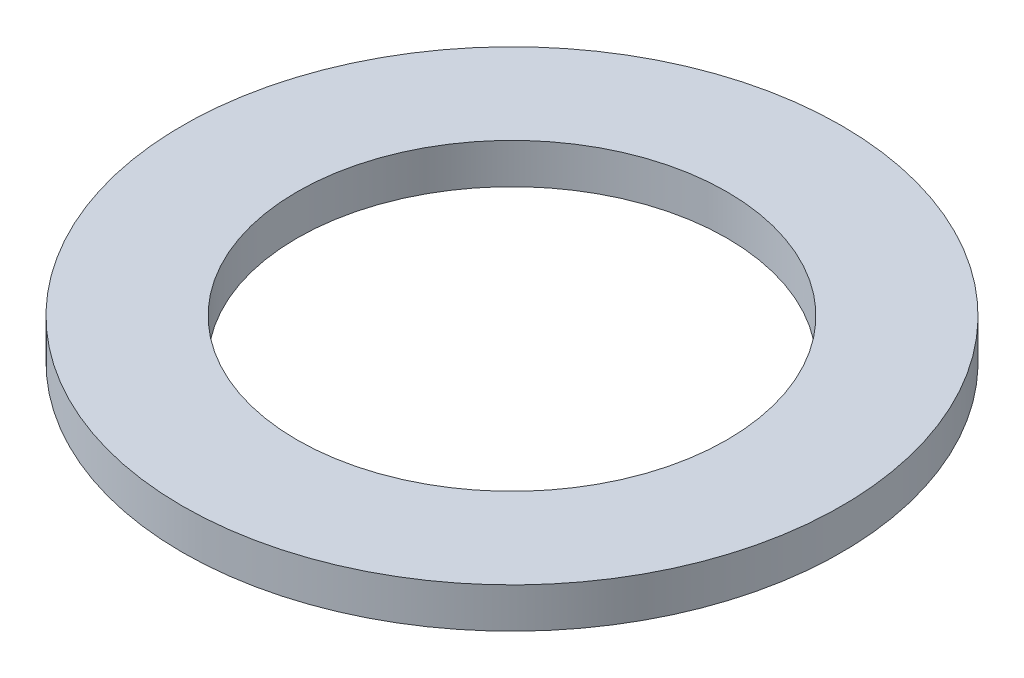
ISO-10303-21;
HEADER;
FILE_DESCRIPTION(('STEP AP214'),'2;1');
FILE_NAME('part.step','',(''),(''),'','','');
FILE_SCHEMA(('AUTOMOTIVE_DESIGN { 1 0 10303 214 1 1 1 1 }'));
ENDSEC;
DATA;
#1=APPLICATION_CONTEXT('core data for automotive mechanical design processes');
#2=APPLICATION_PROTOCOL_DEFINITION('international standard','automotive_design',2000,#1);
#3=PRODUCT_CONTEXT('',#1,'mechanical');
#4=PRODUCT('Part','Part','',(#3));
#5=PRODUCT_RELATED_PRODUCT_CATEGORY('part','',(#4));
#6=PRODUCT_DEFINITION_FORMATION('','',#4);
#7=PRODUCT_DEFINITION_CONTEXT('part definition',#1,'design');
#8=PRODUCT_DEFINITION('design','',#6,#7);
#9=PRODUCT_DEFINITION_SHAPE('','',#8);
#10=(LENGTH_UNIT() NAMED_UNIT(*) SI_UNIT(.MILLI.,.METRE.));
#11=(NAMED_UNIT(*) PLANE_ANGLE_UNIT() SI_UNIT($,.RADIAN.));
#12=(NAMED_UNIT(*) SI_UNIT($,.STERADIAN.) SOLID_ANGLE_UNIT());
#13=UNCERTAINTY_MEASURE_WITH_UNIT(LENGTH_MEASURE(1.E-05),#10,'distance_accuracy_value','');
#14=(GEOMETRIC_REPRESENTATION_CONTEXT(3) GLOBAL_UNCERTAINTY_ASSIGNED_CONTEXT((#13)) GLOBAL_UNIT_ASSIGNED_CONTEXT((#10,
#11,#12)) REPRESENTATION_CONTEXT('',''));
#15=CARTESIAN_POINT('',(0.,0.,0.));
#16=DIRECTION('',(0.,0.,1.));
#17=DIRECTION('',(1.,0.,0.));
#18=AXIS2_PLACEMENT_3D('',#15,#16,#17);
#19=CARTESIAN_POINT('',(0.,7.,0.));
#20=DIRECTION('',(0.,-1.,0.));
#21=DIRECTION('',(0.,0.,-1.));
#22=AXIS2_PLACEMENT_3D('',#19,#20,#21);
#23=CYLINDRICAL_SURFACE('',#22,57.5);
#24=CARTESIAN_POINT('',(0.,7.,0.));
#25=DIRECTION('',(0.,1.,0.));
#26=DIRECTION('',(0.,0.,1.));
#27=AXIS2_PLACEMENT_3D('',#24,#25,#26);
#28=CIRCLE('',#27,57.5);
#29=CARTESIAN_POINT('',(0.,7.,57.5));
#30=VERTEX_POINT('',#29);
#31=EDGE_CURVE('E10',#30,#30,#28,.T.);
#32=ORIENTED_EDGE('',*,*,#31,.F.);
#33=EDGE_LOOP('',(#32));
#34=FACE_BOUND('',#33,.T.);
#35=CARTESIAN_POINT('',(0.,0.,0.));
#36=DIRECTION('',(0.,1.,0.));
#37=DIRECTION('',(0.,0.,1.));
#38=AXIS2_PLACEMENT_3D('',#35,#36,#37);
#39=CIRCLE('',#38,57.5);
#40=CARTESIAN_POINT('',(0.,0.,57.5));
#41=VERTEX_POINT('',#40);
#42=EDGE_CURVE('E37',#41,#41,#39,.T.);
#43=ORIENTED_EDGE('',*,*,#42,.T.);
#44=EDGE_LOOP('',(#43));
#45=FACE_BOUND('',#44,.T.);
#46=ADVANCED_FACE('F40',(#34,#45),#23,.T.);
#47=CARTESIAN_POINT('',(0.,7.,0.));
#48=DIRECTION('',(0.,1.,0.));
#49=DIRECTION('',(0.,0.,1.));
#50=AXIS2_PLACEMENT_3D('',#47,#48,#49);
#51=PLANE('',#50);
#52=CARTESIAN_POINT('',(0.,7.,0.));
#53=DIRECTION('',(0.,1.,0.));
#54=DIRECTION('',(0.,0.,1.));
#55=AXIS2_PLACEMENT_3D('',#52,#53,#54);
#56=CIRCLE('',#55,37.5);
#57=CARTESIAN_POINT('',(0.,7.,37.5));
#58=VERTEX_POINT('',#57);
#59=EDGE_CURVE('E50',#58,#58,#56,.T.);
#60=ORIENTED_EDGE('',*,*,#59,.F.);
#61=EDGE_LOOP('',(#60));
#62=FACE_BOUND('',#61,.T.);
#63=ORIENTED_EDGE('',*,*,#31,.T.);
#64=EDGE_LOOP('',(#63));
#65=FACE_BOUND('',#64,.T.);
#66=ADVANCED_FACE('F59',(#62,#65),#51,.T.);
#67=CARTESIAN_POINT('',(0.,0.,0.));
#68=DIRECTION('',(0.,1.,0.));
#69=DIRECTION('',(0.,0.,1.));
#70=AXIS2_PLACEMENT_3D('',#67,#68,#69);
#71=PLANE('',#70);
#72=CARTESIAN_POINT('',(0.,0.,0.));
#73=DIRECTION('',(0.,1.,0.));
#74=DIRECTION('',(0.,0.,1.));
#75=AXIS2_PLACEMENT_3D('',#72,#73,#74);
#76=CIRCLE('',#75,37.5);
#77=CARTESIAN_POINT('',(0.,0.,37.5));
#78=VERTEX_POINT('',#77);
#79=EDGE_CURVE('E47',#78,#78,#76,.T.);
#80=ORIENTED_EDGE('',*,*,#79,.T.);
#81=EDGE_LOOP('',(#80));
#82=FACE_BOUND('',#81,.T.);
#83=ORIENTED_EDGE('',*,*,#42,.F.);
#84=EDGE_LOOP('',(#83));
#85=FACE_BOUND('',#84,.T.);
#86=ADVANCED_FACE('F58',(#82,#85),#71,.F.);
#87=CARTESIAN_POINT('',(0.,7.,0.));
#88=DIRECTION('',(0.,-1.,0.));
#89=DIRECTION('',(0.,0.,-1.));
#90=AXIS2_PLACEMENT_3D('',#87,#88,#89);
#91=CYLINDRICAL_SURFACE('',#90,37.5);
#92=ORIENTED_EDGE('',*,*,#59,.T.);
#93=EDGE_LOOP('',(#92));
#94=FACE_BOUND('',#93,.T.);
#95=ORIENTED_EDGE('',*,*,#79,.F.);
#96=EDGE_LOOP('',(#95));
#97=FACE_BOUND('',#96,.T.);
#98=ADVANCED_FACE('F54',(#94,#97),#91,.F.);
#99=CLOSED_SHELL('',(#46,#66,#86,#98));
#100=MANIFOLD_SOLID_BREP('B2',#99);
#101=ADVANCED_BREP_SHAPE_REPRESENTATION('',(#18,#100),#14);
#102=SHAPE_DEFINITION_REPRESENTATION(#9,#101);
ENDSEC;
END-ISO-10303-21;
